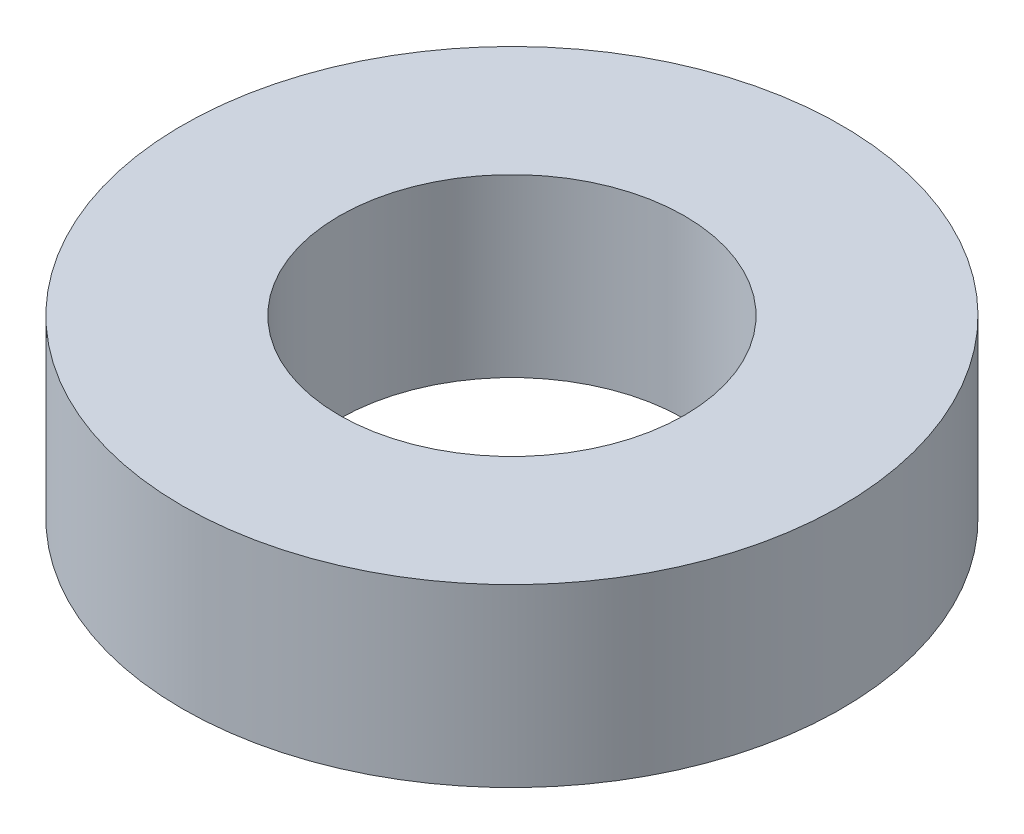
ISO-10303-21;
HEADER;
FILE_DESCRIPTION(('STEP AP214'),'2;1');
FILE_NAME('part.step','',(''),(''),'','','');
FILE_SCHEMA(('AUTOMOTIVE_DESIGN { 1 0 10303 214 1 1 1 1 }'));
ENDSEC;
DATA;
#1=APPLICATION_CONTEXT('core data for automotive mechanical design processes');
#2=APPLICATION_PROTOCOL_DEFINITION('international standard','automotive_design',2000,#1);
#3=PRODUCT_CONTEXT('',#1,'mechanical');
#4=PRODUCT('Part','Part','',(#3));
#5=PRODUCT_RELATED_PRODUCT_CATEGORY('part','',(#4));
#6=PRODUCT_DEFINITION_FORMATION('','',#4);
#7=PRODUCT_DEFINITION_CONTEXT('part definition',#1,'design');
#8=PRODUCT_DEFINITION('design','',#6,#7);
#9=PRODUCT_DEFINITION_SHAPE('','',#8);
#10=(LENGTH_UNIT() NAMED_UNIT(*) SI_UNIT(.MILLI.,.METRE.));
#11=(NAMED_UNIT(*) PLANE_ANGLE_UNIT() SI_UNIT($,.RADIAN.));
#12=(NAMED_UNIT(*) SI_UNIT($,.STERADIAN.) SOLID_ANGLE_UNIT());
#13=UNCERTAINTY_MEASURE_WITH_UNIT(LENGTH_MEASURE(1.E-05),#10,'distance_accuracy_value','');
#14=(GEOMETRIC_REPRESENTATION_CONTEXT(3) GLOBAL_UNCERTAINTY_ASSIGNED_CONTEXT((#13)) GLOBAL_UNIT_ASSIGNED_CONTEXT((#10,
#11,#12)) REPRESENTATION_CONTEXT('',''));
#15=CARTESIAN_POINT('',(0.,0.,0.));
#16=DIRECTION('',(0.,0.,1.));
#17=DIRECTION('',(1.,0.,0.));
#18=AXIS2_PLACEMENT_3D('',#15,#16,#17);
#19=CARTESIAN_POINT('',(0.,28.,0.));
#20=DIRECTION('',(0.,-1.,0.));
#21=DIRECTION('',(0.,0.,-1.));
#22=AXIS2_PLACEMENT_3D('',#19,#20,#21);
#23=CYLINDRICAL_SURFACE('',#22,52.5);
#24=CARTESIAN_POINT('',(0.,28.,0.));
#25=DIRECTION('',(0.,1.,0.));
#26=DIRECTION('',(0.,0.,1.));
#27=AXIS2_PLACEMENT_3D('',#24,#25,#26);
#28=CIRCLE('',#27,52.5);
#29=CARTESIAN_POINT('',(0.,28.,52.5));
#30=VERTEX_POINT('',#29);
#31=EDGE_CURVE('E10',#30,#30,#28,.T.);
#32=ORIENTED_EDGE('',*,*,#31,.F.);
#33=EDGE_LOOP('',(#32));
#34=FACE_BOUND('',#33,.T.);
#35=CARTESIAN_POINT('',(0.,0.,0.));
#36=DIRECTION('',(0.,1.,0.));
#37=DIRECTION('',(0.,0.,1.));
#38=AXIS2_PLACEMENT_3D('',#35,#36,#37);
#39=CIRCLE('',#38,52.5);
#40=CARTESIAN_POINT('',(0.,0.,52.5));
#41=VERTEX_POINT('',#40);
#42=EDGE_CURVE('E37',#41,#41,#39,.T.);
#43=ORIENTED_EDGE('',*,*,#42,.T.);
#44=EDGE_LOOP('',(#43));
#45=FACE_BOUND('',#44,.T.);
#46=ADVANCED_FACE('F40',(#34,#45),#23,.T.);
#47=CARTESIAN_POINT('',(0.,28.,0.));
#48=DIRECTION('',(0.,1.,0.));
#49=DIRECTION('',(0.,0.,1.));
#50=AXIS2_PLACEMENT_3D('',#47,#48,#49);
#51=PLANE('',#50);
#52=CARTESIAN_POINT('',(0.,28.,0.));
#53=DIRECTION('',(0.,1.,0.));
#54=DIRECTION('',(0.,0.,1.));
#55=AXIS2_PLACEMENT_3D('',#52,#53,#54);
#56=CIRCLE('',#55,27.5);
#57=CARTESIAN_POINT('',(0.,28.,27.5));
#58=VERTEX_POINT('',#57);
#59=EDGE_CURVE('E50',#58,#58,#56,.T.);
#60=ORIENTED_EDGE('',*,*,#59,.F.);
#61=EDGE_LOOP('',(#60));
#62=FACE_BOUND('',#61,.T.);
#63=ORIENTED_EDGE('',*,*,#31,.T.);
#64=EDGE_LOOP('',(#63));
#65=FACE_BOUND('',#64,.T.);
#66=ADVANCED_FACE('F59',(#62,#65),#51,.T.);
#67=CARTESIAN_POINT('',(0.,0.,0.));
#68=DIRECTION('',(0.,1.,0.));
#69=DIRECTION('',(0.,0.,1.));
#70=AXIS2_PLACEMENT_3D('',#67,#68,#69);
#71=PLANE('',#70);
#72=CARTESIAN_POINT('',(0.,0.,0.));
#73=DIRECTION('',(0.,1.,0.));
#74=DIRECTION('',(0.,0.,1.));
#75=AXIS2_PLACEMENT_3D('',#72,#73,#74);
#76=CIRCLE('',#75,27.5);
#77=CARTESIAN_POINT('',(0.,0.,27.5));
#78=VERTEX_POINT('',#77);
#79=EDGE_CURVE('E47',#78,#78,#76,.T.);
#80=ORIENTED_EDGE('',*,*,#79,.T.);
#81=EDGE_LOOP('',(#80));
#82=FACE_BOUND('',#81,.T.);
#83=ORIENTED_EDGE('',*,*,#42,.F.);
#84=EDGE_LOOP('',(#83));
#85=FACE_BOUND('',#84,.T.);
#86=ADVANCED_FACE('F58',(#82,#85),#71,.F.);
#87=CARTESIAN_POINT('',(0.,28.,0.));
#88=DIRECTION('',(0.,-1.,0.));
#89=DIRECTION('',(0.,0.,-1.));
#90=AXIS2_PLACEMENT_3D('',#87,#88,#89);
#91=CYLINDRICAL_SURFACE('',#90,27.5);
#92=ORIENTED_EDGE('',*,*,#59,.T.);
#93=EDGE_LOOP('',(#92));
#94=FACE_BOUND('',#93,.T.);
#95=ORIENTED_EDGE('',*,*,#79,.F.);
#96=EDGE_LOOP('',(#95));
#97=FACE_BOUND('',#96,.T.);
#98=ADVANCED_FACE('F54',(#94,#97),#91,.F.);
#99=CLOSED_SHELL('',(#46,#66,#86,#98));
#100=MANIFOLD_SOLID_BREP('B2',#99);
#101=ADVANCED_BREP_SHAPE_REPRESENTATION('',(#18,#100),#14);
#102=SHAPE_DEFINITION_REPRESENTATION(#9,#101);
ENDSEC;
END-ISO-10303-21;
